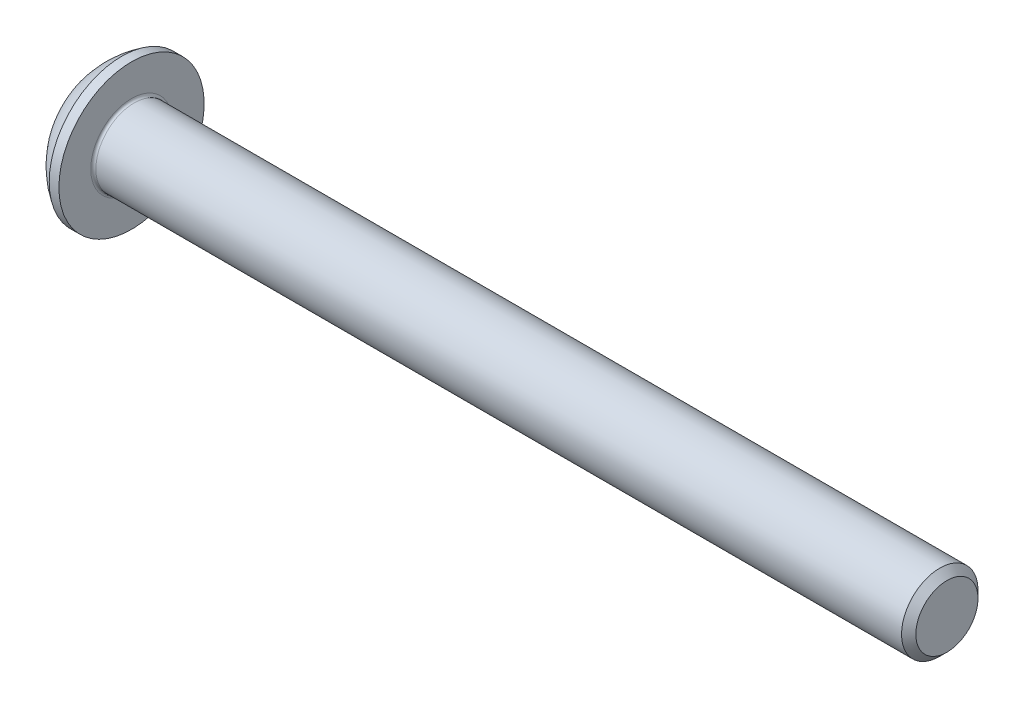
ISO-10303-21;
HEADER;
FILE_DESCRIPTION(('STEP AP214'),'2;1');
FILE_NAME('part.step','',(''),(''),'','','');
FILE_SCHEMA(('AUTOMOTIVE_DESIGN { 1 0 10303 214 1 1 1 1 }'));
ENDSEC;
DATA;
#1=APPLICATION_CONTEXT('core data for automotive mechanical design processes');
#2=APPLICATION_PROTOCOL_DEFINITION('international standard','automotive_design',2000,#1);
#3=PRODUCT_CONTEXT('',#1,'mechanical');
#4=PRODUCT('Part','Part','',(#3));
#5=PRODUCT_RELATED_PRODUCT_CATEGORY('part','',(#4));
#6=PRODUCT_DEFINITION_FORMATION('','',#4);
#7=PRODUCT_DEFINITION_CONTEXT('part definition',#1,'design');
#8=PRODUCT_DEFINITION('design','',#6,#7);
#9=PRODUCT_DEFINITION_SHAPE('','',#8);
#10=(LENGTH_UNIT() NAMED_UNIT(*) SI_UNIT(.MILLI.,.METRE.));
#11=(NAMED_UNIT(*) PLANE_ANGLE_UNIT() SI_UNIT($,.RADIAN.));
#12=(NAMED_UNIT(*) SI_UNIT($,.STERADIAN.) SOLID_ANGLE_UNIT());
#13=UNCERTAINTY_MEASURE_WITH_UNIT(LENGTH_MEASURE(1.E-05),#10,'distance_accuracy_value','');
#14=(GEOMETRIC_REPRESENTATION_CONTEXT(3) GLOBAL_UNCERTAINTY_ASSIGNED_CONTEXT((#13)) GLOBAL_UNIT_ASSIGNED_CONTEXT((#10,
#11,#12)) REPRESENTATION_CONTEXT('',''));
#15=CARTESIAN_POINT('',(0.,0.,0.));
#16=DIRECTION('',(0.,0.,1.));
#17=DIRECTION('',(1.,0.,0.));
#18=AXIS2_PLACEMENT_3D('',#15,#16,#17);
#19=CARTESIAN_POINT('',(0.,0.,0.));
#20=DIRECTION('',(-1.,0.,0.));
#21=DIRECTION('',(0.,0.,1.));
#22=AXIS2_PLACEMENT_3D('',#19,#20,#21);
#23=PLANE('',#22);
#24=CARTESIAN_POINT('',(0.,0.,0.));
#25=DIRECTION('',(-1.,0.,0.));
#26=DIRECTION('',(0.,0.,1.));
#27=AXIS2_PLACEMENT_3D('',#24,#25,#26);
#28=CIRCLE('',#27,1.425);
#29=CARTESIAN_POINT('',(0.,0.,1.425));
#30=VERTEX_POINT('',#29);
#31=EDGE_CURVE('E152',#30,#30,#28,.T.);
#32=ORIENTED_EDGE('',*,*,#31,.T.);
#33=EDGE_LOOP('',(#32));
#34=FACE_BOUND('',#33,.T.);
#35=DIRECTION('',(0.,-1.,0.));
#36=VECTOR('',#35,1.);
#37=CARTESIAN_POINT('',(0.,-0.577350269189625,0.999999999999998));
#38=LINE('',#37,#36);
#39=CARTESIAN_POINT('',(0.,0.577350269189628,1.));
#40=VERTEX_POINT('',#39);
#41=CARTESIAN_POINT('',(0.,-0.577350269189625,0.999999999999998));
#42=VERTEX_POINT('',#41);
#43=EDGE_CURVE('E47',#40,#42,#38,.T.);
#44=ORIENTED_EDGE('',*,*,#43,.T.);
#45=DIRECTION('',(0.,-0.499999999999999,-0.866025403784439));
#46=VECTOR('',#45,1.);
#47=CARTESIAN_POINT('',(0.,-1.15470053837925,0.));
#48=LINE('',#47,#46);
#49=CARTESIAN_POINT('',(0.,-1.15470053837925,0.));
#50=VERTEX_POINT('',#49);
#51=EDGE_CURVE('E272',#42,#50,#48,.T.);
#52=ORIENTED_EDGE('',*,*,#51,.T.);
#53=DIRECTION('',(0.,0.499999999999997,-0.86602540378444));
#54=VECTOR('',#53,1.);
#55=CARTESIAN_POINT('',(0.,-0.577350269189626,-1.));
#56=LINE('',#55,#54);
#57=CARTESIAN_POINT('',(0.,-0.577350269189626,-1.));
#58=VERTEX_POINT('',#57);
#59=EDGE_CURVE('E127',#50,#58,#56,.T.);
#60=ORIENTED_EDGE('',*,*,#59,.T.);
#61=DIRECTION('',(0.,1.,0.));
#62=VECTOR('',#61,1.);
#63=CARTESIAN_POINT('',(0.,0.577350269189628,-1.));
#64=LINE('',#63,#62);
#65=CARTESIAN_POINT('',(0.,0.577350269189628,-1.));
#66=VERTEX_POINT('',#65);
#67=EDGE_CURVE('E275',#58,#66,#64,.T.);
#68=ORIENTED_EDGE('',*,*,#67,.T.);
#69=DIRECTION('',(0.,0.499999999999999,0.866025403784439));
#70=VECTOR('',#69,1.);
#71=CARTESIAN_POINT('',(0.,1.15470053837925,0.));
#72=LINE('',#71,#70);
#73=CARTESIAN_POINT('',(0.,1.15470053837925,0.));
#74=VERTEX_POINT('',#73);
#75=EDGE_CURVE('E277',#66,#74,#72,.T.);
#76=ORIENTED_EDGE('',*,*,#75,.T.);
#77=DIRECTION('',(0.,-0.499999999999998,0.866025403784439));
#78=VECTOR('',#77,1.);
#79=CARTESIAN_POINT('',(0.,0.577350269189628,1.));
#80=LINE('',#79,#78);
#81=EDGE_CURVE('E279',#74,#40,#80,.T.);
#82=ORIENTED_EDGE('',*,*,#81,.T.);
#83=EDGE_LOOP('',(#44,#52,#60,#68,#76,#82));
#84=FACE_BOUND('',#83,.T.);
#85=ADVANCED_FACE('F32',(#34,#84),#23,.T.);
#86=CARTESIAN_POINT('',(3.03337598425198,0.,0.));
#87=DIRECTION('',(-1.,0.,0.));
#88=DIRECTION('',(0.,1.,0.));
#89=AXIS2_PLACEMENT_3D('',#86,#87,#88);
#90=SPHERICAL_SURFACE('',#89,3.35141684393879);
#91=CARTESIAN_POINT('',(1.27,0.,0.));
#92=DIRECTION('',(-1.,0.,0.));
#93=DIRECTION('',(0.,0.,1.));
#94=AXIS2_PLACEMENT_3D('',#91,#92,#93);
#95=CIRCLE('',#94,2.85);
#96=CARTESIAN_POINT('',(1.27,0.,2.85));
#97=VERTEX_POINT('',#96);
#98=EDGE_CURVE('E149',#97,#97,#95,.T.);
#99=ORIENTED_EDGE('',*,*,#98,.T.);
#100=EDGE_LOOP('',(#99));
#101=FACE_BOUND('',#100,.T.);
#102=ORIENTED_EDGE('',*,*,#31,.F.);
#103=EDGE_LOOP('',(#102));
#104=FACE_BOUND('',#103,.T.);
#105=ADVANCED_FACE('F173',(#101,#104),#90,.T.);
#106=CARTESIAN_POINT('',(0.,0.,0.));
#107=DIRECTION('',(-1.,0.,0.));
#108=DIRECTION('',(0.,0.,1.));
#109=AXIS2_PLACEMENT_3D('',#106,#107,#108);
#110=CYLINDRICAL_SURFACE('',#109,2.85);
#111=ORIENTED_EDGE('',*,*,#98,.F.);
#112=EDGE_LOOP('',(#111));
#113=FACE_BOUND('',#112,.T.);
#114=CARTESIAN_POINT('',(1.65,0.,0.));
#115=DIRECTION('',(-1.,0.,0.));
#116=DIRECTION('',(0.,0.,1.));
#117=AXIS2_PLACEMENT_3D('',#114,#115,#116);
#118=CIRCLE('',#117,2.85);
#119=CARTESIAN_POINT('',(1.65,0.,2.85));
#120=VERTEX_POINT('',#119);
#121=EDGE_CURVE('E146',#120,#120,#118,.T.);
#122=ORIENTED_EDGE('',*,*,#121,.T.);
#123=EDGE_LOOP('',(#122));
#124=FACE_BOUND('',#123,.T.);
#125=ADVANCED_FACE('F178',(#113,#124),#110,.T.);
#126=CARTESIAN_POINT('',(1.65,1.49999999999999,0.));
#127=DIRECTION('',(-1.,0.,0.));
#128=DIRECTION('',(0.,0.,1.));
#129=AXIS2_PLACEMENT_3D('',#126,#127,#128);
#130=PLANE('',#129);
#131=CARTESIAN_POINT('',(1.65,0.,0.));
#132=DIRECTION('',(-1.,0.,0.));
#133=DIRECTION('',(0.,0.,1.));
#134=AXIS2_PLACEMENT_3D('',#131,#132,#133);
#135=CIRCLE('',#134,1.6);
#136=CARTESIAN_POINT('',(1.65,0.,1.6));
#137=VERTEX_POINT('',#136);
#138=EDGE_CURVE('E40',#137,#137,#135,.T.);
#139=ORIENTED_EDGE('',*,*,#138,.T.);
#140=EDGE_LOOP('',(#139));
#141=FACE_BOUND('',#140,.T.);
#142=ORIENTED_EDGE('',*,*,#121,.F.);
#143=EDGE_LOOP('',(#142));
#144=FACE_BOUND('',#143,.T.);
#145=ADVANCED_FACE('F157',(#141,#144),#130,.F.);
#146=CARTESIAN_POINT('',(0.,0.,0.));
#147=DIRECTION('',(-1.,0.,0.));
#148=DIRECTION('',(0.,0.,1.));
#149=AXIS2_PLACEMENT_3D('',#146,#147,#148);
#150=CYLINDRICAL_SURFACE('',#149,1.5);
#151=CARTESIAN_POINT('',(1.75,0.,0.));
#152=DIRECTION('',(-1.,0.,0.));
#153=DIRECTION('',(0.,0.,1.));
#154=AXIS2_PLACEMENT_3D('',#151,#152,#153);
#155=CIRCLE('',#154,1.5);
#156=CARTESIAN_POINT('',(1.75,0.,1.5));
#157=VERTEX_POINT('',#156);
#158=EDGE_CURVE('E11',#157,#157,#155,.F.);
#159=ORIENTED_EDGE('',*,*,#158,.T.);
#160=EDGE_LOOP('',(#159));
#161=FACE_BOUND('',#160,.T.);
#162=CARTESIAN_POINT('',(33.3695,0.,0.));
#163=DIRECTION('',(-1.,0.,0.));
#164=DIRECTION('',(0.,0.,1.));
#165=AXIS2_PLACEMENT_3D('',#162,#163,#164);
#166=CIRCLE('',#165,1.5);
#167=CARTESIAN_POINT('',(33.3695,0.,1.5));
#168=VERTEX_POINT('',#167);
#169=EDGE_CURVE('E143',#168,#168,#166,.T.);
#170=ORIENTED_EDGE('',*,*,#169,.T.);
#171=EDGE_LOOP('',(#170));
#172=FACE_BOUND('',#171,.T.);
#173=ADVANCED_FACE('F187',(#161,#172),#150,.T.);
#174=CARTESIAN_POINT('',(33.65,0.,0.));
#175=DIRECTION('',(-1.,0.,0.));
#176=DIRECTION('',(0.,0.,1.));
#177=AXIS2_PLACEMENT_3D('',#174,#175,#176);
#178=CONICAL_SURFACE('',#177,1.2195,0.785398163397426);
#179=ORIENTED_EDGE('',*,*,#169,.F.);
#180=EDGE_LOOP('',(#179));
#181=FACE_BOUND('',#180,.T.);
#182=CARTESIAN_POINT('',(33.65,0.,0.));
#183=DIRECTION('',(-1.,0.,0.));
#184=DIRECTION('',(0.,0.,1.));
#185=AXIS2_PLACEMENT_3D('',#182,#183,#184);
#186=CIRCLE('',#185,1.2195);
#187=CARTESIAN_POINT('',(33.65,0.,1.2195));
#188=VERTEX_POINT('',#187);
#189=EDGE_CURVE('E139',#188,#188,#186,.T.);
#190=ORIENTED_EDGE('',*,*,#189,.T.);
#191=EDGE_LOOP('',(#190));
#192=FACE_BOUND('',#191,.T.);
#193=ADVANCED_FACE('F168',(#181,#192),#178,.T.);
#194=CARTESIAN_POINT('',(33.65,0.,0.));
#195=DIRECTION('',(-1.,0.,0.));
#196=DIRECTION('',(0.,0.,1.));
#197=AXIS2_PLACEMENT_3D('',#194,#195,#196);
#198=PLANE('',#197);
#199=ORIENTED_EDGE('',*,*,#189,.F.);
#200=EDGE_LOOP('',(#199));
#201=FACE_BOUND('',#200,.T.);
#202=ADVANCED_FACE('F161',(#201),#198,.F.);
#203=CARTESIAN_POINT('',(1.75,0.,0.));
#204=DIRECTION('',(-1.,0.,0.));
#205=DIRECTION('',(0.,0.,1.));
#206=AXIS2_PLACEMENT_3D('',#203,#204,#205);
#207=TOROIDAL_SURFACE('',#206,1.6,0.1);
#208=ORIENTED_EDGE('',*,*,#158,.F.);
#209=EDGE_LOOP('',(#208));
#210=FACE_BOUND('',#209,.T.);
#211=ORIENTED_EDGE('',*,*,#138,.F.);
#212=EDGE_LOOP('',(#211));
#213=FACE_BOUND('',#212,.T.);
#214=ADVANCED_FACE('F34',(#210,#213),#207,.F.);
#215=CARTESIAN_POINT('',(1.04,-1.15470053837925,0.));
#216=DIRECTION('',(0.,0.866025403784439,-0.499999999999999));
#217=DIRECTION('',(0.,0.499999999999999,0.866025403784439));
#218=AXIS2_PLACEMENT_3D('',#215,#216,#217);
#219=PLANE('',#218);
#220=DIRECTION('',(0.,-0.499999999999999,-0.866025403784439));
#221=VECTOR('',#220,1.);
#222=CARTESIAN_POINT('',(1.04,-1.15470053837925,0.));
#223=LINE('',#222,#221);
#224=CARTESIAN_POINT('',(1.04,-0.577350269189625,0.999999999999998));
#225=VERTEX_POINT('',#224);
#226=CARTESIAN_POINT('',(1.04,-0.866025403784437,0.499999999999998));
#227=VERTEX_POINT('',#226);
#228=EDGE_CURVE('E113',#225,#227,#223,.T.);
#229=ORIENTED_EDGE('',*,*,#228,.T.);
#230=CARTESIAN_POINT('',(1.04,-1.15470053837925,0.));
#231=VERTEX_POINT('',#230);
#232=EDGE_CURVE('E108',#227,#231,#223,.T.);
#233=ORIENTED_EDGE('',*,*,#232,.T.);
#234=DIRECTION('',(-1.,0.,0.));
#235=VECTOR('',#234,1.);
#236=CARTESIAN_POINT('',(1.04,-1.15470053837925,0.));
#237=LINE('',#236,#235);
#238=EDGE_CURVE('E110',#231,#50,#237,.T.);
#239=ORIENTED_EDGE('',*,*,#238,.T.);
#240=ORIENTED_EDGE('',*,*,#51,.F.);
#241=DIRECTION('',(-1.,0.,0.));
#242=VECTOR('',#241,1.);
#243=CARTESIAN_POINT('',(1.04,-0.577350269189625,0.999999999999998));
#244=LINE('',#243,#242);
#245=EDGE_CURVE('E268',#225,#42,#244,.T.);
#246=ORIENTED_EDGE('',*,*,#245,.F.);
#247=EDGE_LOOP('',(#229,#233,#239,#240,#246));
#248=FACE_BOUND('',#247,.T.);
#249=ADVANCED_FACE('F109',(#248),#219,.T.);
#250=CARTESIAN_POINT('',(1.04,-0.577350269189626,-1.));
#251=DIRECTION('',(0.,0.86602540378444,0.499999999999998));
#252=DIRECTION('',(0.,-0.499999999999998,0.86602540378444));
#253=AXIS2_PLACEMENT_3D('',#250,#251,#252);
#254=PLANE('',#253);
#255=DIRECTION('',(0.,0.499999999999997,-0.86602540378444));
#256=VECTOR('',#255,1.);
#257=CARTESIAN_POINT('',(1.04,-0.577350269189626,-1.));
#258=LINE('',#257,#256);
#259=CARTESIAN_POINT('',(1.04,-0.86602540378444,-0.499999999999997));
#260=VERTEX_POINT('',#259);
#261=EDGE_CURVE('E55',#231,#260,#258,.T.);
#262=ORIENTED_EDGE('',*,*,#261,.T.);
#263=CARTESIAN_POINT('',(1.04,-0.577350269189626,-1.));
#264=VERTEX_POINT('',#263);
#265=EDGE_CURVE('E122',#260,#264,#258,.T.);
#266=ORIENTED_EDGE('',*,*,#265,.T.);
#267=DIRECTION('',(-1.,0.,0.));
#268=VECTOR('',#267,1.);
#269=CARTESIAN_POINT('',(1.04,-0.577350269189626,-1.));
#270=LINE('',#269,#268);
#271=EDGE_CURVE('E129',#264,#58,#270,.T.);
#272=ORIENTED_EDGE('',*,*,#271,.T.);
#273=ORIENTED_EDGE('',*,*,#59,.F.);
#274=ORIENTED_EDGE('',*,*,#238,.F.);
#275=EDGE_LOOP('',(#262,#266,#272,#273,#274));
#276=FACE_BOUND('',#275,.T.);
#277=ADVANCED_FACE('F125',(#276),#254,.T.);
#278=CARTESIAN_POINT('',(1.04,0.577350269189628,-1.));
#279=DIRECTION('',(0.,0.,1.));
#280=DIRECTION('',(1.,0.,0.));
#281=AXIS2_PLACEMENT_3D('',#278,#279,#280);
#282=PLANE('',#281);
#283=DIRECTION('',(0.,1.,0.));
#284=VECTOR('',#283,1.);
#285=CARTESIAN_POINT('',(1.04,0.577350269189628,-1.));
#286=LINE('',#285,#284);
#287=CARTESIAN_POINT('',(1.04,0.,-1.));
#288=VERTEX_POINT('',#287);
#289=EDGE_CURVE('E249',#264,#288,#286,.T.);
#290=ORIENTED_EDGE('',*,*,#289,.T.);
#291=CARTESIAN_POINT('',(1.04,0.577350269189628,-1.));
#292=VERTEX_POINT('',#291);
#293=EDGE_CURVE('E121',#288,#292,#286,.T.);
#294=ORIENTED_EDGE('',*,*,#293,.T.);
#295=DIRECTION('',(-1.,0.,0.));
#296=VECTOR('',#295,1.);
#297=CARTESIAN_POINT('',(1.04,0.577350269189628,-1.));
#298=LINE('',#297,#296);
#299=EDGE_CURVE('E134',#292,#66,#298,.T.);
#300=ORIENTED_EDGE('',*,*,#299,.T.);
#301=ORIENTED_EDGE('',*,*,#67,.F.);
#302=ORIENTED_EDGE('',*,*,#271,.F.);
#303=EDGE_LOOP('',(#290,#294,#300,#301,#302));
#304=FACE_BOUND('',#303,.T.);
#305=ADVANCED_FACE('F201',(#304),#282,.T.);
#306=CARTESIAN_POINT('',(1.04,1.15470053837925,0.));
#307=DIRECTION('',(0.,-0.86602540378444,0.499999999999999));
#308=DIRECTION('',(0.,-0.499999999999999,-0.866025403784439));
#309=AXIS2_PLACEMENT_3D('',#306,#307,#308);
#310=PLANE('',#309);
#311=DIRECTION('',(0.,0.499999999999999,0.866025403784439));
#312=VECTOR('',#311,1.);
#313=CARTESIAN_POINT('',(1.04,1.15470053837925,0.));
#314=LINE('',#313,#312);
#315=CARTESIAN_POINT('',(1.04,0.86602540378444,-0.499999999999999));
#316=VERTEX_POINT('',#315);
#317=EDGE_CURVE('E238',#292,#316,#314,.T.);
#318=ORIENTED_EDGE('',*,*,#317,.T.);
#319=CARTESIAN_POINT('',(1.04,1.15470053837925,0.));
#320=VERTEX_POINT('',#319);
#321=EDGE_CURVE('E243',#316,#320,#314,.T.);
#322=ORIENTED_EDGE('',*,*,#321,.T.);
#323=DIRECTION('',(-1.,0.,0.));
#324=VECTOR('',#323,1.);
#325=CARTESIAN_POINT('',(1.04,1.15470053837925,0.));
#326=LINE('',#325,#324);
#327=EDGE_CURVE('E283',#320,#74,#326,.T.);
#328=ORIENTED_EDGE('',*,*,#327,.T.);
#329=ORIENTED_EDGE('',*,*,#75,.F.);
#330=ORIENTED_EDGE('',*,*,#299,.F.);
#331=EDGE_LOOP('',(#318,#322,#328,#329,#330));
#332=FACE_BOUND('',#331,.T.);
#333=ADVANCED_FACE('F204',(#332),#310,.T.);
#334=CARTESIAN_POINT('',(1.04,0.577350269189628,1.));
#335=DIRECTION('',(0.,-0.86602540378444,-0.499999999999998));
#336=DIRECTION('',(0.,0.499999999999998,-0.86602540378444));
#337=AXIS2_PLACEMENT_3D('',#334,#335,#336);
#338=PLANE('',#337);
#339=DIRECTION('',(0.,-0.499999999999998,0.866025403784439));
#340=VECTOR('',#339,1.);
#341=CARTESIAN_POINT('',(1.04,0.577350269189628,1.));
#342=LINE('',#341,#340);
#343=CARTESIAN_POINT('',(1.04,0.86602540378444,0.499999999999999));
#344=VERTEX_POINT('',#343);
#345=EDGE_CURVE('E246',#320,#344,#342,.T.);
#346=ORIENTED_EDGE('',*,*,#345,.T.);
#347=CARTESIAN_POINT('',(1.04,0.577350269189628,1.));
#348=VERTEX_POINT('',#347);
#349=EDGE_CURVE('E254',#344,#348,#342,.T.);
#350=ORIENTED_EDGE('',*,*,#349,.T.);
#351=DIRECTION('',(-1.,0.,0.));
#352=VECTOR('',#351,1.);
#353=CARTESIAN_POINT('',(1.04,0.577350269189628,1.));
#354=LINE('',#353,#352);
#355=EDGE_CURVE('E267',#348,#40,#354,.T.);
#356=ORIENTED_EDGE('',*,*,#355,.T.);
#357=ORIENTED_EDGE('',*,*,#81,.F.);
#358=ORIENTED_EDGE('',*,*,#327,.F.);
#359=EDGE_LOOP('',(#346,#350,#356,#357,#358));
#360=FACE_BOUND('',#359,.T.);
#361=ADVANCED_FACE('F208',(#360),#338,.T.);
#362=CARTESIAN_POINT('',(1.04,-0.577350269189625,0.999999999999998));
#363=DIRECTION('',(0.,0.,-1.));
#364=DIRECTION('',(0.,1.,0.));
#365=AXIS2_PLACEMENT_3D('',#362,#363,#364);
#366=PLANE('',#365);
#367=DIRECTION('',(0.,-1.,0.));
#368=VECTOR('',#367,1.);
#369=CARTESIAN_POINT('',(1.04,-0.577350269189625,0.999999999999998));
#370=LINE('',#369,#368);
#371=CARTESIAN_POINT('',(1.04,0.,1.));
#372=VERTEX_POINT('',#371);
#373=EDGE_CURVE('E260',#348,#372,#370,.T.);
#374=ORIENTED_EDGE('',*,*,#373,.T.);
#375=EDGE_CURVE('E262',#372,#225,#370,.T.);
#376=ORIENTED_EDGE('',*,*,#375,.T.);
#377=ORIENTED_EDGE('',*,*,#245,.T.);
#378=ORIENTED_EDGE('',*,*,#43,.F.);
#379=ORIENTED_EDGE('',*,*,#355,.F.);
#380=EDGE_LOOP('',(#374,#376,#377,#378,#379));
#381=FACE_BOUND('',#380,.T.);
#382=ADVANCED_FACE('F212',(#381),#366,.T.);
#383=CARTESIAN_POINT('',(1.04,-1.73205080756887,-1.));
#384=DIRECTION('',(1.,0.,0.));
#385=DIRECTION('',(0.,0.,-1.));
#386=AXIS2_PLACEMENT_3D('',#383,#384,#385);
#387=PLANE('',#386);
#388=CARTESIAN_POINT('',(1.04,0.,0.));
#389=DIRECTION('',(-1.,0.,0.));
#390=DIRECTION('',(0.,0.,1.));
#391=AXIS2_PLACEMENT_3D('',#388,#389,#390);
#392=CIRCLE('',#391,1.);
#393=EDGE_CURVE('E235',#316,#288,#392,.T.);
#394=ORIENTED_EDGE('',*,*,#393,.F.);
#395=ORIENTED_EDGE('',*,*,#317,.F.);
#396=ORIENTED_EDGE('',*,*,#293,.F.);
#397=EDGE_LOOP('',(#394,#395,#396));
#398=FACE_BOUND('',#397,.T.);
#399=ADVANCED_FACE('F216',(#398),#387,.F.);
#400=EDGE_CURVE('E140',#344,#316,#392,.T.);
#401=ORIENTED_EDGE('',*,*,#400,.F.);
#402=ORIENTED_EDGE('',*,*,#345,.F.);
#403=ORIENTED_EDGE('',*,*,#321,.F.);
#404=EDGE_LOOP('',(#401,#402,#403));
#405=FACE_BOUND('',#404,.T.);
#406=ADVANCED_FACE('F225',(#405),#387,.F.);
#407=EDGE_CURVE('E133',#372,#344,#392,.T.);
#408=ORIENTED_EDGE('',*,*,#407,.F.);
#409=ORIENTED_EDGE('',*,*,#373,.F.);
#410=ORIENTED_EDGE('',*,*,#349,.F.);
#411=EDGE_LOOP('',(#408,#409,#410));
#412=FACE_BOUND('',#411,.T.);
#413=ADVANCED_FACE('F230',(#412),#387,.F.);
#414=EDGE_CURVE('E128',#227,#372,#392,.T.);
#415=ORIENTED_EDGE('',*,*,#414,.F.);
#416=ORIENTED_EDGE('',*,*,#228,.F.);
#417=ORIENTED_EDGE('',*,*,#375,.F.);
#418=EDGE_LOOP('',(#415,#416,#417));
#419=FACE_BOUND('',#418,.T.);
#420=ADVANCED_FACE('F223',(#419),#387,.F.);
#421=EDGE_CURVE('E119',#260,#227,#392,.T.);
#422=ORIENTED_EDGE('',*,*,#421,.F.);
#423=ORIENTED_EDGE('',*,*,#261,.F.);
#424=ORIENTED_EDGE('',*,*,#232,.F.);
#425=EDGE_LOOP('',(#422,#423,#424));
#426=FACE_BOUND('',#425,.T.);
#427=ADVANCED_FACE('F118',(#426),#387,.F.);
#428=EDGE_CURVE('E241',#288,#260,#392,.T.);
#429=ORIENTED_EDGE('',*,*,#428,.F.);
#430=ORIENTED_EDGE('',*,*,#289,.F.);
#431=ORIENTED_EDGE('',*,*,#265,.F.);
#432=EDGE_LOOP('',(#429,#430,#431));
#433=FACE_BOUND('',#432,.T.);
#434=ADVANCED_FACE('F196',(#433),#387,.F.);
#435=CARTESIAN_POINT('',(1.61735026918963,0.,0.));
#436=DIRECTION('',(-1.,0.,0.));
#437=DIRECTION('',(0.,0.,1.));
#438=AXIS2_PLACEMENT_3D('',#435,#436,#437);
#439=CONICAL_SURFACE('',#438,0.,1.04719755119659);
#440=ORIENTED_EDGE('',*,*,#407,.T.);
#441=ORIENTED_EDGE('',*,*,#400,.T.);
#442=ORIENTED_EDGE('',*,*,#393,.T.);
#443=ORIENTED_EDGE('',*,*,#428,.T.);
#444=ORIENTED_EDGE('',*,*,#421,.T.);
#445=ORIENTED_EDGE('',*,*,#414,.T.);
#446=EDGE_LOOP('',(#440,#441,#442,#443,#444,#445));
#447=FACE_BOUND('',#446,.T.);
#448=CARTESIAN_POINT('',(1.61735026918963,0.,0.));
#449=VERTEX_POINT('',#448);
#450=VERTEX_LOOP('',#449);
#451=FACE_BOUND('',#450,.T.);
#452=ADVANCED_FACE('F194',(#447,#451),#439,.F.);
#453=CLOSED_SHELL('',(#85,#105,#125,#145,#173,#193,#202,#214,#249,#277,#305,#333,#361,#382,#399,
#406,#413,#420,#427,#434,#452));
#454=MANIFOLD_SOLID_BREP('B2',#453);
#455=ADVANCED_BREP_SHAPE_REPRESENTATION('',(#18,#454),#14);
#456=SHAPE_DEFINITION_REPRESENTATION(#9,#455);
ENDSEC;
END-ISO-10303-21;
